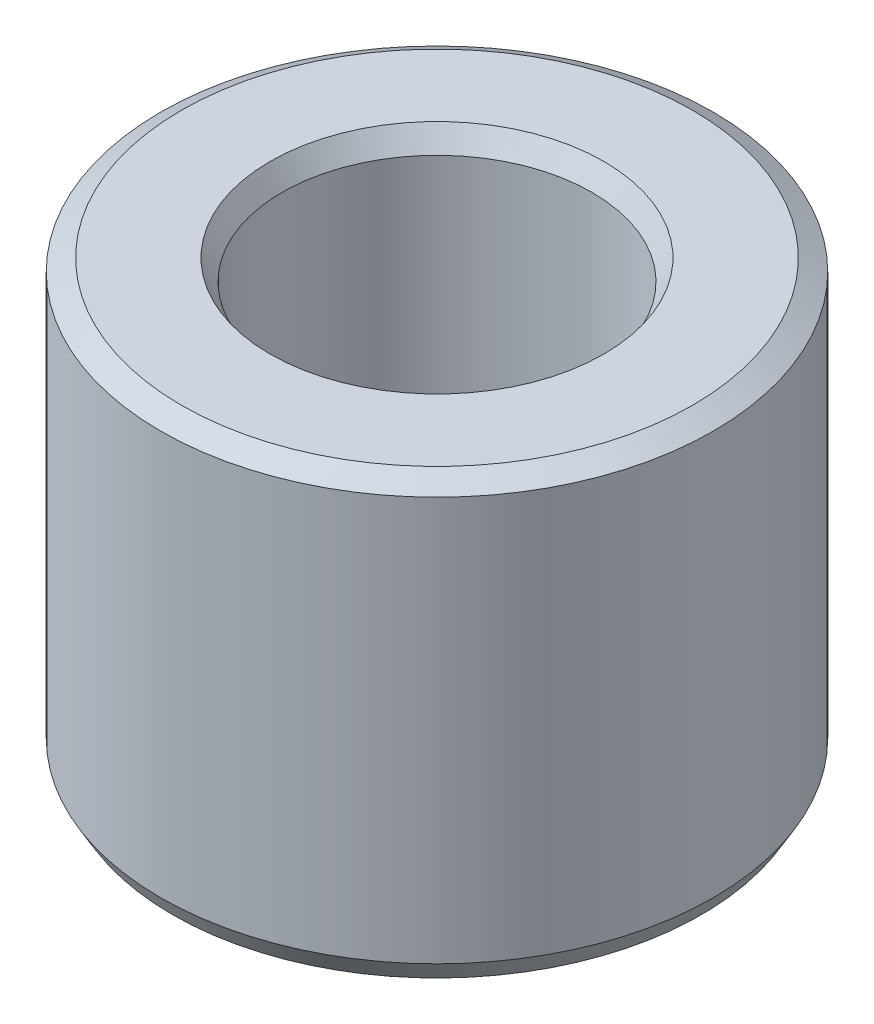
ISO-10303-21;
HEADER;
FILE_DESCRIPTION(('STEP AP214'),'2;1');
FILE_NAME('part.step','',(''),(''),'','','');
FILE_SCHEMA(('AUTOMOTIVE_DESIGN { 1 0 10303 214 1 1 1 1 }'));
ENDSEC;
DATA;
#1=APPLICATION_CONTEXT('core data for automotive mechanical design processes');
#2=APPLICATION_PROTOCOL_DEFINITION('international standard','automotive_design',2000,#1);
#3=PRODUCT_CONTEXT('',#1,'mechanical');
#4=PRODUCT('Part','Part','',(#3));
#5=PRODUCT_RELATED_PRODUCT_CATEGORY('part','',(#4));
#6=PRODUCT_DEFINITION_FORMATION('','',#4);
#7=PRODUCT_DEFINITION_CONTEXT('part definition',#1,'design');
#8=PRODUCT_DEFINITION('design','',#6,#7);
#9=PRODUCT_DEFINITION_SHAPE('','',#8);
#10=(LENGTH_UNIT() NAMED_UNIT(*) SI_UNIT(.MILLI.,.METRE.));
#11=(NAMED_UNIT(*) PLANE_ANGLE_UNIT() SI_UNIT($,.RADIAN.));
#12=(NAMED_UNIT(*) SI_UNIT($,.STERADIAN.) SOLID_ANGLE_UNIT());
#13=UNCERTAINTY_MEASURE_WITH_UNIT(LENGTH_MEASURE(1.E-05),#10,'distance_accuracy_value','');
#14=(GEOMETRIC_REPRESENTATION_CONTEXT(3) GLOBAL_UNCERTAINTY_ASSIGNED_CONTEXT((#13)) GLOBAL_UNIT_ASSIGNED_CONTEXT((#10,
#11,#12)) REPRESENTATION_CONTEXT('',''));
#15=CARTESIAN_POINT('',(0.,0.,0.));
#16=DIRECTION('',(0.,0.,1.));
#17=DIRECTION('',(1.,0.,0.));
#18=AXIS2_PLACEMENT_3D('',#15,#16,#17);
#19=CARTESIAN_POINT('',(0.,86.9571251825127,0.));
#20=DIRECTION('',(0.,-1.,0.));
#21=DIRECTION('',(0.,0.,-1.));
#22=AXIS2_PLACEMENT_3D('',#19,#20,#21);
#23=CYLINDRICAL_SURFACE('',#22,55.);
#24=CARTESIAN_POINT('',(0.,4.13241397598259,0.));
#25=DIRECTION('',(0.,1.,0.));
#26=DIRECTION('',(0.,0.,1.));
#27=AXIS2_PLACEMENT_3D('',#24,#25,#26);
#28=CIRCLE('',#27,55.);
#29=CARTESIAN_POINT('',(0.,4.13241397598259,55.));
#30=VERTEX_POINT('',#29);
#31=EDGE_CURVE('E10',#30,#30,#28,.T.);
#32=ORIENTED_EDGE('',*,*,#31,.T.);
#33=EDGE_LOOP('',(#32));
#34=FACE_BOUND('',#33,.T.);
#35=CARTESIAN_POINT('',(0.,84.5712748610762,0.));
#36=DIRECTION('',(0.,1.,0.));
#37=DIRECTION('',(0.,0.,1.));
#38=AXIS2_PLACEMENT_3D('',#35,#36,#37);
#39=CIRCLE('',#38,55.);
#40=CARTESIAN_POINT('',(0.,84.5712748610762,-55.));
#41=VERTEX_POINT('',#40);
#42=EDGE_CURVE('E50',#41,#41,#39,.F.);
#43=ORIENTED_EDGE('',*,*,#42,.T.);
#44=EDGE_LOOP('',(#43));
#45=FACE_BOUND('',#44,.T.);
#46=ADVANCED_FACE('F39',(#34,#45),#23,.T.);
#47=CARTESIAN_POINT('',(0.,86.9571251825127,0.));
#48=DIRECTION('',(0.,1.,0.));
#49=DIRECTION('',(0.,0.,1.));
#50=AXIS2_PLACEMENT_3D('',#47,#48,#49);
#51=PLANE('',#50);
#52=CARTESIAN_POINT('',(0.,86.9571251825127,0.));
#53=DIRECTION('',(0.,1.,0.));
#54=DIRECTION('',(0.,0.,1.));
#55=AXIS2_PLACEMENT_3D('',#52,#53,#54);
#56=CIRCLE('',#55,33.2178685782103);
#57=CARTESIAN_POINT('',(0.,86.9571251825127,33.2178685782103));
#58=VERTEX_POINT('',#57);
#59=EDGE_CURVE('E58',#58,#58,#56,.F.);
#60=ORIENTED_EDGE('',*,*,#59,.T.);
#61=EDGE_LOOP('',(#60));
#62=FACE_BOUND('',#61,.T.);
#63=CARTESIAN_POINT('',(0.,86.9571251825127,0.));
#64=DIRECTION('',(0.,1.,0.));
#65=DIRECTION('',(0.,0.,1.));
#66=AXIS2_PLACEMENT_3D('',#63,#64,#65);
#67=CIRCLE('',#66,50.8675860240175);
#68=CARTESIAN_POINT('',(0.,86.9571251825127,-50.8675860240175));
#69=VERTEX_POINT('',#68);
#70=EDGE_CURVE('E61',#69,#69,#67,.T.);
#71=ORIENTED_EDGE('',*,*,#70,.T.);
#72=EDGE_LOOP('',(#71));
#73=FACE_BOUND('',#72,.T.);
#74=ADVANCED_FACE('F88',(#62,#73),#51,.T.);
#75=CARTESIAN_POINT('',(0.,0.,0.));
#76=DIRECTION('',(0.,1.,0.));
#77=DIRECTION('',(0.,0.,1.));
#78=AXIS2_PLACEMENT_3D('',#75,#76,#77);
#79=PLANE('',#78);
#80=CARTESIAN_POINT('',(0.,0.,0.));
#81=DIRECTION('',(0.,1.,0.));
#82=DIRECTION('',(0.,0.,1.));
#83=AXIS2_PLACEMENT_3D('',#80,#81,#82);
#84=CIRCLE('',#83,34.9644322327563);
#85=CARTESIAN_POINT('',(0.,0.,-34.9644322327563));
#86=VERTEX_POINT('',#85);
#87=EDGE_CURVE('E51',#86,#86,#84,.T.);
#88=ORIENTED_EDGE('',*,*,#87,.T.);
#89=EDGE_LOOP('',(#88));
#90=FACE_BOUND('',#89,.T.);
#91=CARTESIAN_POINT('',(0.,0.,0.));
#92=DIRECTION('',(0.,1.,0.));
#93=DIRECTION('',(0.,0.,1.));
#94=AXIS2_PLACEMENT_3D('',#91,#92,#93);
#95=CIRCLE('',#94,52.6141496785635);
#96=CARTESIAN_POINT('',(0.,0.,52.6141496785635));
#97=VERTEX_POINT('',#96);
#98=EDGE_CURVE('E54',#97,#97,#95,.F.);
#99=ORIENTED_EDGE('',*,*,#98,.T.);
#100=EDGE_LOOP('',(#99));
#101=FACE_BOUND('',#100,.T.);
#102=ADVANCED_FACE('F83',(#90,#101),#79,.F.);
#103=CARTESIAN_POINT('',(0.,86.9571251825127,0.));
#104=DIRECTION('',(0.,-1.,0.));
#105=DIRECTION('',(0.,0.,-1.));
#106=AXIS2_PLACEMENT_3D('',#103,#104,#105);
#107=CYLINDRICAL_SURFACE('',#106,30.8320182567738);
#108=CARTESIAN_POINT('',(0.,82.8247112065302,0.));
#109=DIRECTION('',(0.,1.,0.));
#110=DIRECTION('',(0.,0.,1.));
#111=AXIS2_PLACEMENT_3D('',#108,#109,#110);
#112=CIRCLE('',#111,30.8320182567738);
#113=CARTESIAN_POINT('',(0.,82.8247112065302,30.8320182567738));
#114=VERTEX_POINT('',#113);
#115=EDGE_CURVE('E67',#114,#114,#112,.T.);
#116=ORIENTED_EDGE('',*,*,#115,.T.);
#117=EDGE_LOOP('',(#116));
#118=FACE_BOUND('',#117,.T.);
#119=CARTESIAN_POINT('',(0.,2.3858503214365,0.));
#120=DIRECTION('',(0.,1.,0.));
#121=DIRECTION('',(0.,0.,1.));
#122=AXIS2_PLACEMENT_3D('',#119,#120,#121);
#123=CIRCLE('',#122,30.8320182567738);
#124=CARTESIAN_POINT('',(0.,2.3858503214365,-30.8320182567738));
#125=VERTEX_POINT('',#124);
#126=EDGE_CURVE('E69',#125,#125,#123,.F.);
#127=ORIENTED_EDGE('',*,*,#126,.T.);
#128=EDGE_LOOP('',(#127));
#129=FACE_BOUND('',#128,.T.);
#130=ADVANCED_FACE('F71',(#118,#129),#107,.F.);
#131=CARTESIAN_POINT('',(0.,82.8247112065302,0.));
#132=DIRECTION('',(0.,1.,0.));
#133=DIRECTION('',(0.,0.,1.));
#134=AXIS2_PLACEMENT_3D('',#131,#132,#133);
#135=CONICAL_SURFACE('',#134,30.8320182567738,0.523598775598303);
#136=ORIENTED_EDGE('',*,*,#59,.F.);
#137=EDGE_LOOP('',(#136));
#138=FACE_BOUND('',#137,.T.);
#139=ORIENTED_EDGE('',*,*,#115,.F.);
#140=EDGE_LOOP('',(#139));
#141=FACE_BOUND('',#140,.T.);
#142=ADVANCED_FACE('F77',(#138,#141),#135,.F.);
#143=CARTESIAN_POINT('',(0.,0.,0.));
#144=DIRECTION('',(0.,-1.,0.));
#145=DIRECTION('',(0.,0.,-1.));
#146=AXIS2_PLACEMENT_3D('',#143,#144,#145);
#147=CONICAL_SURFACE('',#146,34.9644322327563,1.04719755119659);
#148=CARTESIAN_POINT('',(0.,2.3858503214365,-30.8320182567738));
#149=CARTESIAN_POINT('',(0.,2.36099771392153,-30.8750642356903));
#150=CARTESIAN_POINT('',(0.,2.33614510640657,-30.9181102146068));
#151=CARTESIAN_POINT('',(0.,2.28643989137664,-31.0042021724397));
#152=CARTESIAN_POINT('',(0.,2.26158728386168,-31.0472481513562));
#153=CARTESIAN_POINT('',(0.,2.21188206883175,-31.1333401091892));
#154=CARTESIAN_POINT('',(0.,2.18702946131679,-31.1763860881057));
#155=CARTESIAN_POINT('',(0.,2.13732424628686,-31.2624780459387));
#156=CARTESIAN_POINT('',(0.,2.1124716387719,-31.3055240248551));
#157=CARTESIAN_POINT('',(0.,2.06276642374197,-31.3916159826881));
#158=CARTESIAN_POINT('',(0.,2.03791381622701,-31.4346619616046));
#159=CARTESIAN_POINT('',(0.,1.98820860119708,-31.5207539194376));
#160=CARTESIAN_POINT('',(0.,1.96335599368212,-31.563799898354));
#161=CARTESIAN_POINT('',(0.,1.91365077865219,-31.649891856187));
#162=CARTESIAN_POINT('',(0.,1.88879817113723,-31.6929378351035));
#163=CARTESIAN_POINT('',(0.,1.8390929561073,-31.7790297929365));
#164=CARTESIAN_POINT('',(0.,1.81424034859234,-31.822075771853));
#165=CARTESIAN_POINT('',(0.,1.76453513356241,-31.9081677296859));
#166=CARTESIAN_POINT('',(0.,1.73968252604745,-31.9512137086024));
#167=CARTESIAN_POINT('',(0.,1.68997731101752,-32.0373056664354));
#168=CARTESIAN_POINT('',(0.,1.66512470350256,-32.0803516453519));
#169=CARTESIAN_POINT('',(0.,1.61541948847263,-32.1664436031848));
#170=CARTESIAN_POINT('',(0.,1.59056688095766,-32.2094895821013));
#171=CARTESIAN_POINT('',(0.,1.54086166592774,-32.2955815399343));
#172=CARTESIAN_POINT('',(0.,1.51600905841277,-32.3386275188508));
#173=CARTESIAN_POINT('',(0.,1.46630384338285,-32.4247194766837));
#174=CARTESIAN_POINT('',(0.,1.44145123586788,-32.4677654556002));
#175=CARTESIAN_POINT('',(0.,1.39174602083796,-32.5538574134332));
#176=CARTESIAN_POINT('',(0.,1.36689341332299,-32.5969033923497));
#177=CARTESIAN_POINT('',(0.,1.31718819829307,-32.6829953501826));
#178=CARTESIAN_POINT('',(0.,1.2923355907781,-32.7260413290991));
#179=CARTESIAN_POINT('',(0.,1.24263037574817,-32.8121332869321));
#180=CARTESIAN_POINT('',(0.,1.21777776823321,-32.8551792658486));
#181=CARTESIAN_POINT('',(0.,1.16807255320329,-32.9412712236816));
#182=CARTESIAN_POINT('',(0.,1.14321994568832,-32.984317202598));
#183=CARTESIAN_POINT('',(0.,1.09351473065839,-33.070409160431));
#184=CARTESIAN_POINT('',(0.,1.06866212314343,-33.1134551393475));
#185=CARTESIAN_POINT('',(0.,1.0189569081135,-33.1995470971805));
#186=CARTESIAN_POINT('',(0.,0.99410430059854,-33.242593076097));
#187=CARTESIAN_POINT('',(0.,0.944399085568613,-33.3286850339299));
#188=CARTESIAN_POINT('',(0.,0.91954647805365,-33.3717310128464));
#189=CARTESIAN_POINT('',(0.,0.869841263023723,-33.4578229706794));
#190=CARTESIAN_POINT('',(0.,0.844988655508759,-33.5008689495959));
#191=CARTESIAN_POINT('',(0.,0.795283440478832,-33.5869609074288));
#192=CARTESIAN_POINT('',(0.,0.770430832963869,-33.6300068863453));
#193=CARTESIAN_POINT('',(0.,0.720725617933942,-33.7160988441783));
#194=CARTESIAN_POINT('',(0.,0.695873010418978,-33.7591448230948));
#195=CARTESIAN_POINT('',(0.,0.646167795389051,-33.8452367809277));
#196=CARTESIAN_POINT('',(0.,0.621315187874088,-33.8882827598442));
#197=CARTESIAN_POINT('',(0.,0.571609972844161,-33.9743747176772));
#198=CARTESIAN_POINT('',(0.,0.546757365329197,-34.0174206965937));
#199=CARTESIAN_POINT('',(0.,0.49705215029927,-34.1035126544266));
#200=CARTESIAN_POINT('',(0.,0.472199542784307,-34.1465586333431));
#201=CARTESIAN_POINT('',(0.,0.42249432775438,-34.2326505911761));
#202=CARTESIAN_POINT('',(0.,0.397641720239416,-34.2756965700926));
#203=CARTESIAN_POINT('',(0.,0.347936505209489,-34.3617885279255));
#204=CARTESIAN_POINT('',(0.,0.323083897694526,-34.404834506842));
#205=CARTESIAN_POINT('',(0.,0.273378682664599,-34.490926464675));
#206=CARTESIAN_POINT('',(0.,0.248526075149635,-34.5339724435915));
#207=CARTESIAN_POINT('',(0.,0.198820860119708,-34.6200644014245));
#208=CARTESIAN_POINT('',(0.,0.173968252604745,-34.6631103803409));
#209=CARTESIAN_POINT('',(0.,0.124263037574818,-34.7492023381739));
#210=CARTESIAN_POINT('',(0.,0.0994104300598541,-34.7922483170904));
#211=CARTESIAN_POINT('',(0.,0.0497052150299259,-34.8783402749234));
#212=CARTESIAN_POINT('',(0.,0.0248526075149618,-34.9213862538398));
#213=CARTESIAN_POINT('',(0.,0.,-34.9644322327563));
#214=B_SPLINE_CURVE_WITH_KNOTS('',3,(#148,#149,#150,#151,#152,#153,#154,#155,#156,#157,#158,
#159,#160,#161,#162,#163,#164,#165,#166,#167,#168,#169,#170,#171,#172,#173,#174,#175,#176,#177,
#178,#179,#180,#181,#182,#183,#184,#185,#186,#187,#188,#189,#190,#191,#192,#193,#194,#195,#196,
#197,#198,#199,#200,#201,#202,#203,#204,#205,#206,#207,#208,#209,#210,#211,#212,#213),
.UNSPECIFIED.,.F.,.F.,(4,2,2,2,2,2,2,2,2,2,2,2,2,2,2,2,2,2,2,2,2,2,2,2,2,2,2,2,2,2,2,2,4),(0.,
0.14911564508978,0.29823129017956,0.447346935269341,0.596462580359124,0.745578225448901,
0.894693870538684,1.04380951562846,1.19292516071824,1.34204080580802,1.49115645089781,
1.64027209598758,1.78938774107737,1.93850338616714,2.08761903125693,2.2367346763467,
2.38585032143649,2.53496596652626,2.68408161161605,2.83319725670582,2.98231290179561,
3.13142854688538,3.28054419197517,3.42965983706494,3.57877548215473,3.72789112724451,
3.87700677233429,4.02612241742407,4.17523806251385,4.32435370760363,4.47346935269341,
4.62258499778319,4.77170064287297),.UNSPECIFIED.);
#215=EDGE_CURVE('BSEAM73',#125,#86,#214,.T.);
#216=ORIENTED_EDGE('',*,*,#126,.F.);
#217=ORIENTED_EDGE('',*,*,#87,.F.);
#218=ORIENTED_EDGE('',*,*,#215,.T.);
#219=ORIENTED_EDGE('',*,*,#215,.F.);
#220=EDGE_LOOP('',(#216,#218,#217,#219));
#221=FACE_BOUND('',#220,.T.);
#222=ADVANCED_FACE('F73',(#221),#147,.F.);
#223=CARTESIAN_POINT('',(0.,4.13241397598259,0.));
#224=DIRECTION('',(0.,1.,0.));
#225=DIRECTION('',(0.,0.,1.));
#226=AXIS2_PLACEMENT_3D('',#223,#224,#225);
#227=CONICAL_SURFACE('',#226,55.,0.523598775598301);
#228=ORIENTED_EDGE('',*,*,#98,.F.);
#229=EDGE_LOOP('',(#228));
#230=FACE_BOUND('',#229,.T.);
#231=ORIENTED_EDGE('',*,*,#31,.F.);
#232=EDGE_LOOP('',(#231));
#233=FACE_BOUND('',#232,.T.);
#234=ADVANCED_FACE('F76',(#230,#233),#227,.T.);
#235=CARTESIAN_POINT('',(0.,86.9571251825127,0.));
#236=DIRECTION('',(0.,-1.,0.));
#237=DIRECTION('',(0.,0.,-1.));
#238=AXIS2_PLACEMENT_3D('',#235,#236,#237);
#239=CONICAL_SURFACE('',#238,50.8675860240175,1.0471975511966);
#240=CARTESIAN_POINT('',(0.,84.5712748610762,-55.));
#241=CARTESIAN_POINT('',(0.,84.5961274685911,-54.9569540210835));
#242=CARTESIAN_POINT('',(0.,84.6209800761061,-54.913908042167));
#243=CARTESIAN_POINT('',(0.,84.670685291136,-54.8278160843341));
#244=CARTESIAN_POINT('',(0.,84.695537898651,-54.7847701054176));
#245=CARTESIAN_POINT('',(0.,84.7452431136809,-54.6986781475846));
#246=CARTESIAN_POINT('',(0.,84.7700957211959,-54.6556321686681));
#247=CARTESIAN_POINT('',(0.,84.8198009362258,-54.5695402108352));
#248=CARTESIAN_POINT('',(0.,84.8446535437408,-54.5264942319187));
#249=CARTESIAN_POINT('',(0.,84.8943587587707,-54.4404022740857));
#250=CARTESIAN_POINT('',(0.,84.9192113662857,-54.3973562951692));
#251=CARTESIAN_POINT('',(0.,84.9689165813156,-54.3112643373363));
#252=CARTESIAN_POINT('',(0.,84.9937691888306,-54.2682183584198));
#253=CARTESIAN_POINT('',(0.,85.0434744038605,-54.1821264005868));
#254=CARTESIAN_POINT('',(0.,85.0683270113755,-54.1390804216703));
#255=CARTESIAN_POINT('',(0.,85.1180322264054,-54.0529884638373));
#256=CARTESIAN_POINT('',(0.,85.1428848339203,-54.0099424849209));
#257=CARTESIAN_POINT('',(0.,85.1925900489503,-53.9238505270879));
#258=CARTESIAN_POINT('',(0.,85.2174426564652,-53.8808045481714));
#259=CARTESIAN_POINT('',(0.,85.2671478714952,-53.7947125903384));
#260=CARTESIAN_POINT('',(0.,85.2920004790101,-53.751666611422));
#261=CARTESIAN_POINT('',(0.,85.34170569404,-53.665574653589));
#262=CARTESIAN_POINT('',(0.,85.366558301555,-53.6225286746725));
#263=CARTESIAN_POINT('',(0.,85.4162635165849,-53.5364367168395));
#264=CARTESIAN_POINT('',(0.,85.4411161240999,-53.4933907379231));
#265=CARTESIAN_POINT('',(0.,85.4908213391298,-53.4072987800901));
#266=CARTESIAN_POINT('',(0.,85.5156739466448,-53.3642528011736));
#267=CARTESIAN_POINT('',(0.,85.5653791616747,-53.2781608433406));
#268=CARTESIAN_POINT('',(0.,85.5902317691897,-53.2351148644241));
#269=CARTESIAN_POINT('',(0.,85.6399369842196,-53.1490229065912));
#270=CARTESIAN_POINT('',(0.,85.6647895917346,-53.1059769276747));
#271=CARTESIAN_POINT('',(0.,85.7144948067645,-53.0198849698417));
#272=CARTESIAN_POINT('',(0.,85.7393474142795,-52.9768389909252));
#273=CARTESIAN_POINT('',(0.,85.7890526293094,-52.8907470330923));
#274=CARTESIAN_POINT('',(0.,85.8139052368244,-52.8477010541758));
#275=CARTESIAN_POINT('',(0.,85.8636104518543,-52.7616090963428));
#276=CARTESIAN_POINT('',(0.,85.8884630593692,-52.7185631174263));
#277=CARTESIAN_POINT('',(0.,85.9381682743992,-52.6324711595934));
#278=CARTESIAN_POINT('',(0.,85.9630208819141,-52.5894251806769));
#279=CARTESIAN_POINT('',(0.,86.0127260969441,-52.5033332228439));
#280=CARTESIAN_POINT('',(0.,86.037578704459,-52.4602872439274));
#281=CARTESIAN_POINT('',(0.,86.0872839194889,-52.3741952860944));
#282=CARTESIAN_POINT('',(0.,86.1121365270039,-52.331149307178));
#283=CARTESIAN_POINT('',(0.,86.1618417420338,-52.245057349345));
#284=CARTESIAN_POINT('',(0.,86.1866943495488,-52.2020113704285));
#285=CARTESIAN_POINT('',(0.,86.2363995645787,-52.1159194125955));
#286=CARTESIAN_POINT('',(0.,86.2612521720937,-52.072873433679));
#287=CARTESIAN_POINT('',(0.,86.3109573871236,-51.9867814758461));
#288=CARTESIAN_POINT('',(0.,86.3358099946386,-51.9437354969296));
#289=CARTESIAN_POINT('',(0.,86.3855152096685,-51.8576435390966));
#290=CARTESIAN_POINT('',(0.,86.4103678171835,-51.8145975601801));
#291=CARTESIAN_POINT('',(0.,86.4600730322134,-51.7285056023472));
#292=CARTESIAN_POINT('',(0.,86.4849256397284,-51.6854596234307));
#293=CARTESIAN_POINT('',(0.,86.5346308547583,-51.5993676655977));
#294=CARTESIAN_POINT('',(0.,86.5594834622733,-51.5563216866812));
#295=CARTESIAN_POINT('',(0.,86.6091886773032,-51.4702297288483));
#296=CARTESIAN_POINT('',(0.,86.6340412848182,-51.4271837499318));
#297=CARTESIAN_POINT('',(0.,86.6837464998481,-51.3410917920988));
#298=CARTESIAN_POINT('',(0.,86.708599107363,-51.2980458131823));
#299=CARTESIAN_POINT('',(0.,86.758304322393,-51.2119538553494));
#300=CARTESIAN_POINT('',(0.,86.7831569299079,-51.1689078764329));
#301=CARTESIAN_POINT('',(0.,86.8328621449378,-51.0828159185999));
#302=CARTESIAN_POINT('',(0.,86.8577147524528,-51.0397699396834));
#303=CARTESIAN_POINT('',(0.,86.9074199674828,-50.9536779818505));
#304=CARTESIAN_POINT('',(0.,86.9322725749977,-50.910632002934));
#305=CARTESIAN_POINT('',(0.,86.9571251825127,-50.8675860240175));
#306=B_SPLINE_CURVE_WITH_KNOTS('',3,(#240,#241,#242,#243,#244,#245,#246,#247,#248,#249,#250,
#251,#252,#253,#254,#255,#256,#257,#258,#259,#260,#261,#262,#263,#264,#265,#266,#267,#268,#269,
#270,#271,#272,#273,#274,#275,#276,#277,#278,#279,#280,#281,#282,#283,#284,#285,#286,#287,#288,
#289,#290,#291,#292,#293,#294,#295,#296,#297,#298,#299,#300,#301,#302,#303,#304,#305),
.UNSPECIFIED.,.F.,.F.,(4,2,2,2,2,2,2,2,2,2,2,2,2,2,2,2,2,2,2,2,2,2,2,2,2,2,2,2,2,2,2,2,4),(0.,
0.149115645089786,0.298231290179566,0.447346935269345,0.596462580359125,0.745578225448904,
0.89469387053869,1.04380951562847,1.19292516071825,1.34204080580803,1.49115645089781,
1.64027209598759,1.78938774107737,1.93850338616715,2.08761903125693,2.23673467634671,
2.38585032143649,2.53496596652628,2.68408161161605,2.83319725670584,2.98231290179561,
3.1314285468854,3.28054419197518,3.42965983706496,3.57877548215474,3.72789112724452,
3.8770067723343,4.02612241742408,4.17523806251386,4.32435370760365,4.47346935269342,
4.62258499778321,4.77170064287299),.UNSPECIFIED.);
#307=EDGE_CURVE('BSEAM45',#41,#69,#306,.T.);
#308=ORIENTED_EDGE('',*,*,#42,.F.);
#309=ORIENTED_EDGE('',*,*,#70,.F.);
#310=ORIENTED_EDGE('',*,*,#307,.T.);
#311=ORIENTED_EDGE('',*,*,#307,.F.);
#312=EDGE_LOOP('',(#308,#310,#309,#311));
#313=FACE_BOUND('',#312,.T.);
#314=ADVANCED_FACE('F45',(#313),#239,.T.);
#315=CLOSED_SHELL('',(#46,#74,#102,#130,#142,#222,#234,#314));
#316=MANIFOLD_SOLID_BREP('B2',#315);
#317=ADVANCED_BREP_SHAPE_REPRESENTATION('',(#18,#316),#14);
#318=SHAPE_DEFINITION_REPRESENTATION(#9,#317);
ENDSEC;
END-ISO-10303-21;
